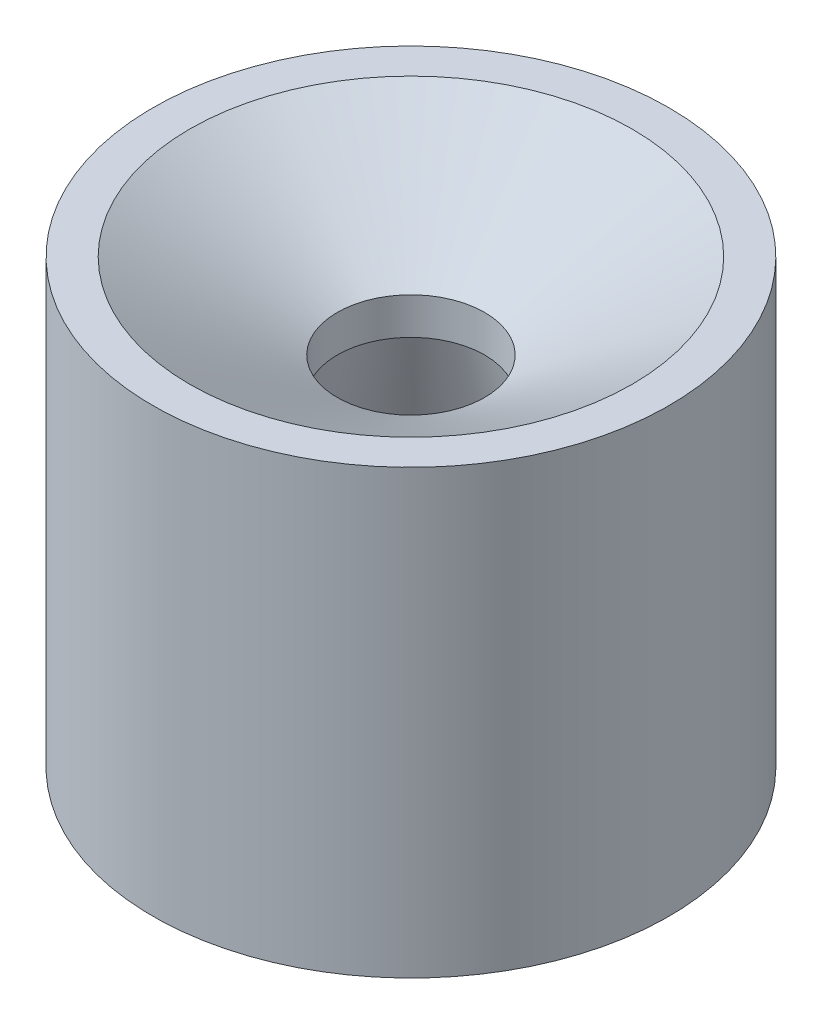
ISO-10303-21;
HEADER;
FILE_DESCRIPTION(('STEP AP214'),'2;1');
FILE_NAME('part.step','',(''),(''),'','','');
FILE_SCHEMA(('AUTOMOTIVE_DESIGN { 1 0 10303 214 1 1 1 1 }'));
ENDSEC;
DATA;
#1=APPLICATION_CONTEXT('core data for automotive mechanical design processes');
#2=APPLICATION_PROTOCOL_DEFINITION('international standard','automotive_design',2000,#1);
#3=PRODUCT_CONTEXT('',#1,'mechanical');
#4=PRODUCT('Part','Part','',(#3));
#5=PRODUCT_RELATED_PRODUCT_CATEGORY('part','',(#4));
#6=PRODUCT_DEFINITION_FORMATION('','',#4);
#7=PRODUCT_DEFINITION_CONTEXT('part definition',#1,'design');
#8=PRODUCT_DEFINITION('design','',#6,#7);
#9=PRODUCT_DEFINITION_SHAPE('','',#8);
#10=(LENGTH_UNIT() NAMED_UNIT(*) SI_UNIT(.MILLI.,.METRE.));
#11=(NAMED_UNIT(*) PLANE_ANGLE_UNIT() SI_UNIT($,.RADIAN.));
#12=(NAMED_UNIT(*) SI_UNIT($,.STERADIAN.) SOLID_ANGLE_UNIT());
#13=UNCERTAINTY_MEASURE_WITH_UNIT(LENGTH_MEASURE(1.E-05),#10,'distance_accuracy_value','');
#14=(GEOMETRIC_REPRESENTATION_CONTEXT(3) GLOBAL_UNCERTAINTY_ASSIGNED_CONTEXT((#13)) GLOBAL_UNIT_ASSIGNED_CONTEXT((#10,
#11,#12)) REPRESENTATION_CONTEXT('',''));
#15=CARTESIAN_POINT('',(0.,0.,0.));
#16=DIRECTION('',(0.,0.,1.));
#17=DIRECTION('',(1.,0.,0.));
#18=AXIS2_PLACEMENT_3D('',#15,#16,#17);
#19=CARTESIAN_POINT('',(-28.321,0.,0.));
#20=DIRECTION('',(0.,1.,0.));
#21=DIRECTION('',(0.,0.,1.));
#22=AXIS2_PLACEMENT_3D('',#19,#20,#21);
#23=PLANE('',#22);
#24=CARTESIAN_POINT('',(0.,0.,0.));
#25=DIRECTION('',(0.,-1.,0.));
#26=DIRECTION('',(0.,0.,-1.));
#27=AXIS2_PLACEMENT_3D('',#24,#25,#26);
#28=CIRCLE('',#27,28.321);
#29=CARTESIAN_POINT('',(0.,0.,-28.321));
#30=VERTEX_POINT('',#29);
#31=EDGE_CURVE('E56',#30,#30,#28,.T.);
#32=ORIENTED_EDGE('',*,*,#31,.F.);
#33=EDGE_LOOP('',(#32));
#34=FACE_BOUND('',#33,.T.);
#35=CARTESIAN_POINT('',(0.,0.,0.));
#36=DIRECTION('',(0.,-1.,0.));
#37=DIRECTION('',(0.,0.,-1.));
#38=AXIS2_PLACEMENT_3D('',#35,#36,#37);
#39=CIRCLE('',#38,44.45);
#40=CARTESIAN_POINT('',(0.,0.,-44.45));
#41=VERTEX_POINT('',#40);
#42=EDGE_CURVE('E10',#41,#41,#39,.T.);
#43=ORIENTED_EDGE('',*,*,#42,.T.);
#44=EDGE_LOOP('',(#43));
#45=FACE_BOUND('',#44,.T.);
#46=ADVANCED_FACE('F34',(#34,#45),#23,.F.);
#47=CARTESIAN_POINT('',(0.,0.,0.));
#48=DIRECTION('',(0.,-1.,0.));
#49=DIRECTION('',(0.,0.,-1.));
#50=AXIS2_PLACEMENT_3D('',#47,#48,#49);
#51=CYLINDRICAL_SURFACE('',#50,44.45);
#52=ORIENTED_EDGE('',*,*,#42,.F.);
#53=EDGE_LOOP('',(#52));
#54=FACE_BOUND('',#53,.T.);
#55=CARTESIAN_POINT('',(0.,76.2,0.));
#56=DIRECTION('',(0.,-1.,0.));
#57=DIRECTION('',(0.,0.,-1.));
#58=AXIS2_PLACEMENT_3D('',#55,#56,#57);
#59=CIRCLE('',#58,44.45);
#60=CARTESIAN_POINT('',(0.,76.2,-44.45));
#61=VERTEX_POINT('',#60);
#62=EDGE_CURVE('E40',#61,#61,#59,.T.);
#63=ORIENTED_EDGE('',*,*,#62,.T.);
#64=EDGE_LOOP('',(#63));
#65=FACE_BOUND('',#64,.T.);
#66=ADVANCED_FACE('F63',(#54,#65),#51,.T.);
#67=CARTESIAN_POINT('',(-44.45,76.2,0.));
#68=DIRECTION('',(0.,-1.,0.));
#69=DIRECTION('',(0.,0.,-1.));
#70=AXIS2_PLACEMENT_3D('',#67,#68,#69);
#71=PLANE('',#70);
#72=ORIENTED_EDGE('',*,*,#62,.F.);
#73=EDGE_LOOP('',(#72));
#74=FACE_BOUND('',#73,.T.);
#75=CARTESIAN_POINT('',(0.,76.2,0.));
#76=DIRECTION('',(0.,-1.,0.));
#77=DIRECTION('',(0.,0.,-1.));
#78=AXIS2_PLACEMENT_3D('',#75,#76,#77);
#79=CIRCLE('',#78,38.1);
#80=CARTESIAN_POINT('',(0.,76.2,-38.1));
#81=VERTEX_POINT('',#80);
#82=EDGE_CURVE('E44',#81,#81,#79,.T.);
#83=ORIENTED_EDGE('',*,*,#82,.T.);
#84=EDGE_LOOP('',(#83));
#85=FACE_BOUND('',#84,.T.);
#86=ADVANCED_FACE('F67',(#74,#85),#71,.F.);
#87=CARTESIAN_POINT('',(0.,61.5353031625835,0.));
#88=DIRECTION('',(0.,1.,0.));
#89=DIRECTION('',(0.,0.,1.));
#90=AXIS2_PLACEMENT_3D('',#87,#88,#89);
#91=CONICAL_SURFACE('',#90,12.7,1.0471975511966);
#92=ORIENTED_EDGE('',*,*,#82,.F.);
#93=EDGE_LOOP('',(#92));
#94=FACE_BOUND('',#93,.T.);
#95=CARTESIAN_POINT('',(0.,61.5353031625835,0.));
#96=DIRECTION('',(0.,-1.,0.));
#97=DIRECTION('',(0.,0.,-1.));
#98=AXIS2_PLACEMENT_3D('',#95,#96,#97);
#99=CIRCLE('',#98,12.7);
#100=CARTESIAN_POINT('',(0.,61.5353031625835,-12.7));
#101=VERTEX_POINT('',#100);
#102=EDGE_CURVE('E48',#101,#101,#99,.T.);
#103=ORIENTED_EDGE('',*,*,#102,.T.);
#104=EDGE_LOOP('',(#103));
#105=FACE_BOUND('',#104,.T.);
#106=ADVANCED_FACE('F72',(#94,#105),#91,.F.);
#107=CARTESIAN_POINT('',(0.,0.,0.));
#108=DIRECTION('',(0.,-1.,0.));
#109=DIRECTION('',(0.,0.,-1.));
#110=AXIS2_PLACEMENT_3D('',#107,#108,#109);
#111=CYLINDRICAL_SURFACE('',#110,12.7);
#112=ORIENTED_EDGE('',*,*,#102,.F.);
#113=EDGE_LOOP('',(#112));
#114=FACE_BOUND('',#113,.T.);
#115=CARTESIAN_POINT('',(0.,55.1853031625835,0.));
#116=DIRECTION('',(0.,-1.,0.));
#117=DIRECTION('',(0.,0.,-1.));
#118=AXIS2_PLACEMENT_3D('',#115,#116,#117);
#119=CIRCLE('',#118,12.7);
#120=CARTESIAN_POINT('',(0.,55.1853031625835,-12.7));
#121=VERTEX_POINT('',#120);
#122=EDGE_CURVE('E53',#121,#121,#119,.T.);
#123=ORIENTED_EDGE('',*,*,#122,.T.);
#124=EDGE_LOOP('',(#123));
#125=FACE_BOUND('',#124,.T.);
#126=ADVANCED_FACE('F78',(#114,#125),#111,.F.);
#127=CARTESIAN_POINT('',(0.,0.,0.));
#128=DIRECTION('',(0.,-1.,0.));
#129=DIRECTION('',(0.,0.,-1.));
#130=AXIS2_PLACEMENT_3D('',#127,#128,#129);
#131=CONICAL_SURFACE('',#130,28.321,0.27584814196086);
#132=ORIENTED_EDGE('',*,*,#122,.F.);
#133=EDGE_LOOP('',(#132));
#134=FACE_BOUND('',#133,.T.);
#135=ORIENTED_EDGE('',*,*,#31,.T.);
#136=EDGE_LOOP('',(#135));
#137=FACE_BOUND('',#136,.T.);
#138=ADVANCED_FACE('F60',(#134,#137),#131,.F.);
#139=CLOSED_SHELL('',(#46,#66,#86,#106,#126,#138));
#140=MANIFOLD_SOLID_BREP('B2',#139);
#141=ADVANCED_BREP_SHAPE_REPRESENTATION('',(#18,#140),#14);
#142=SHAPE_DEFINITION_REPRESENTATION(#9,#141);
ENDSEC;
END-ISO-10303-21;
